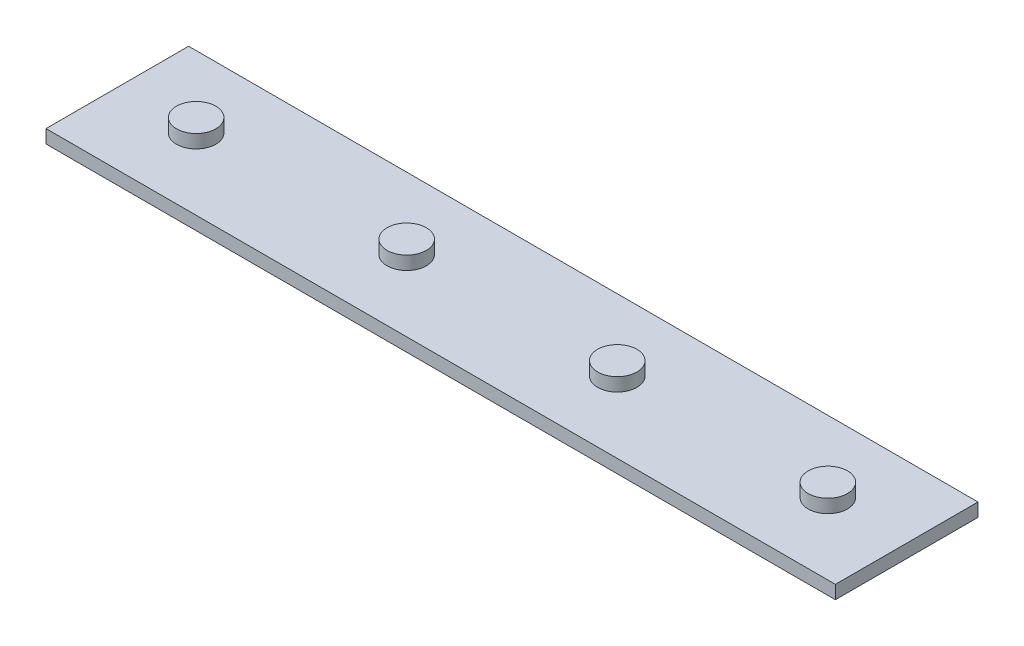
ISO-10303-21;
HEADER;
FILE_DESCRIPTION(('STEP AP214'),'2;1');
FILE_NAME('part.step','',(''),(''),'','','');
FILE_SCHEMA(('AUTOMOTIVE_DESIGN { 1 0 10303 214 1 1 1 1 }'));
ENDSEC;
DATA;
#1=APPLICATION_CONTEXT('core data for automotive mechanical design processes');
#2=APPLICATION_PROTOCOL_DEFINITION('international standard','automotive_design',2000,#1);
#3=PRODUCT_CONTEXT('',#1,'mechanical');
#4=PRODUCT('Part','Part','',(#3));
#5=PRODUCT_RELATED_PRODUCT_CATEGORY('part','',(#4));
#6=PRODUCT_DEFINITION_FORMATION('','',#4);
#7=PRODUCT_DEFINITION_CONTEXT('part definition',#1,'design');
#8=PRODUCT_DEFINITION('design','',#6,#7);
#9=PRODUCT_DEFINITION_SHAPE('','',#8);
#10=(LENGTH_UNIT() NAMED_UNIT(*) SI_UNIT(.MILLI.,.METRE.));
#11=(NAMED_UNIT(*) PLANE_ANGLE_UNIT() SI_UNIT($,.RADIAN.));
#12=(NAMED_UNIT(*) SI_UNIT($,.STERADIAN.) SOLID_ANGLE_UNIT());
#13=UNCERTAINTY_MEASURE_WITH_UNIT(LENGTH_MEASURE(1.E-05),#10,'distance_accuracy_value','');
#14=(GEOMETRIC_REPRESENTATION_CONTEXT(3) GLOBAL_UNCERTAINTY_ASSIGNED_CONTEXT((#13)) GLOBAL_UNIT_ASSIGNED_CONTEXT((#10,
#11,#12)) REPRESENTATION_CONTEXT('',''));
#15=CARTESIAN_POINT('',(0.,0.,0.));
#16=DIRECTION('',(0.,0.,1.));
#17=DIRECTION('',(1.,0.,0.));
#18=AXIS2_PLACEMENT_3D('',#15,#16,#17);
#19=CARTESIAN_POINT('',(140.579448456349,9.525,-25.4));
#20=DIRECTION('',(-1.,0.,0.));
#21=DIRECTION('',(0.,0.,1.));
#22=AXIS2_PLACEMENT_3D('',#19,#20,#21);
#23=PLANE('',#22);
#24=DIRECTION('',(0.,0.,-1.));
#25=VECTOR('',#24,1.);
#26=CARTESIAN_POINT('',(140.579448456349,4.7625,-25.4));
#27=LINE('',#26,#25);
#28=CARTESIAN_POINT('',(140.579448456349,4.7625,25.4));
#29=VERTEX_POINT('',#28);
#30=CARTESIAN_POINT('',(140.579448456349,4.7625,-25.4));
#31=VERTEX_POINT('',#30);
#32=EDGE_CURVE('E71',#29,#31,#27,.T.);
#33=ORIENTED_EDGE('',*,*,#32,.F.);
#34=DIRECTION('',(0.,-1.,0.));
#35=VECTOR('',#34,1.);
#36=CARTESIAN_POINT('',(140.579448456349,9.525,25.4));
#37=LINE('',#36,#35);
#38=CARTESIAN_POINT('',(140.579448456349,0.,25.4));
#39=VERTEX_POINT('',#38);
#40=EDGE_CURVE('E53',#29,#39,#37,.T.);
#41=ORIENTED_EDGE('',*,*,#40,.T.);
#42=DIRECTION('',(0.,0.,-1.));
#43=VECTOR('',#42,1.);
#44=CARTESIAN_POINT('',(140.579448456349,0.,-25.4));
#45=LINE('',#44,#43);
#46=CARTESIAN_POINT('',(140.579448456349,0.,-25.4));
#47=VERTEX_POINT('',#46);
#48=EDGE_CURVE('E76',#39,#47,#45,.T.);
#49=ORIENTED_EDGE('',*,*,#48,.T.);
#50=DIRECTION('',(0.,-1.,0.));
#51=VECTOR('',#50,1.);
#52=CARTESIAN_POINT('',(140.579448456349,9.525,-25.4));
#53=LINE('',#52,#51);
#54=EDGE_CURVE('E39',#31,#47,#53,.T.);
#55=ORIENTED_EDGE('',*,*,#54,.F.);
#56=EDGE_LOOP('',(#33,#41,#49,#55));
#57=FACE_BOUND('',#56,.T.);
#58=ADVANCED_FACE('F32',(#57),#23,.F.);
#59=CARTESIAN_POINT('',(-140.579448456349,9.525,-25.4));
#60=DIRECTION('',(0.,0.,1.));
#61=DIRECTION('',(1.,0.,0.));
#62=AXIS2_PLACEMENT_3D('',#59,#60,#61);
#63=PLANE('',#62);
#64=DIRECTION('',(-1.,0.,0.));
#65=VECTOR('',#64,1.);
#66=CARTESIAN_POINT('',(-140.579448456349,4.7625,-25.4));
#67=LINE('',#66,#65);
#68=CARTESIAN_POINT('',(-140.579448456349,4.7625,-25.4));
#69=VERTEX_POINT('',#68);
#70=EDGE_CURVE('E77',#31,#69,#67,.T.);
#71=ORIENTED_EDGE('',*,*,#70,.F.);
#72=ORIENTED_EDGE('',*,*,#54,.T.);
#73=DIRECTION('',(-1.,0.,0.));
#74=VECTOR('',#73,1.);
#75=CARTESIAN_POINT('',(-140.579448456349,0.,-25.4));
#76=LINE('',#75,#74);
#77=CARTESIAN_POINT('',(-140.579448456349,0.,-25.4));
#78=VERTEX_POINT('',#77);
#79=EDGE_CURVE('E96',#47,#78,#76,.T.);
#80=ORIENTED_EDGE('',*,*,#79,.T.);
#81=DIRECTION('',(0.,-1.,0.));
#82=VECTOR('',#81,1.);
#83=CARTESIAN_POINT('',(-140.579448456349,9.525,-25.4));
#84=LINE('',#83,#82);
#85=EDGE_CURVE('E85',#69,#78,#84,.T.);
#86=ORIENTED_EDGE('',*,*,#85,.F.);
#87=EDGE_LOOP('',(#71,#72,#80,#86));
#88=FACE_BOUND('',#87,.T.);
#89=ADVANCED_FACE('F94',(#88),#63,.F.);
#90=CARTESIAN_POINT('',(-140.579448456349,9.525,-25.4));
#91=DIRECTION('',(1.,0.,0.));
#92=DIRECTION('',(0.,0.,-1.));
#93=AXIS2_PLACEMENT_3D('',#90,#91,#92);
#94=PLANE('',#93);
#95=DIRECTION('',(0.,0.,1.));
#96=VECTOR('',#95,1.);
#97=CARTESIAN_POINT('',(-140.579448456349,4.7625,-25.4));
#98=LINE('',#97,#96);
#99=CARTESIAN_POINT('',(-140.579448456349,4.7625,25.4));
#100=VERTEX_POINT('',#99);
#101=EDGE_CURVE('E45',#69,#100,#98,.T.);
#102=ORIENTED_EDGE('',*,*,#101,.F.);
#103=ORIENTED_EDGE('',*,*,#85,.T.);
#104=DIRECTION('',(0.,0.,1.));
#105=VECTOR('',#104,1.);
#106=CARTESIAN_POINT('',(-140.579448456349,0.,-25.4));
#107=LINE('',#106,#105);
#108=CARTESIAN_POINT('',(-140.579448456349,0.,25.4));
#109=VERTEX_POINT('',#108);
#110=EDGE_CURVE('E87',#78,#109,#107,.T.);
#111=ORIENTED_EDGE('',*,*,#110,.T.);
#112=DIRECTION('',(0.,-1.,0.));
#113=VECTOR('',#112,1.);
#114=CARTESIAN_POINT('',(-140.579448456349,9.525,25.4));
#115=LINE('',#114,#113);
#116=EDGE_CURVE('E83',#100,#109,#115,.T.);
#117=ORIENTED_EDGE('',*,*,#116,.F.);
#118=EDGE_LOOP('',(#102,#103,#111,#117));
#119=FACE_BOUND('',#118,.T.);
#120=ADVANCED_FACE('F105',(#119),#94,.F.);
#121=CARTESIAN_POINT('',(-140.579448456349,9.525,25.4));
#122=DIRECTION('',(0.,0.,-1.));
#123=DIRECTION('',(-1.,0.,0.));
#124=AXIS2_PLACEMENT_3D('',#121,#122,#123);
#125=PLANE('',#124);
#126=DIRECTION('',(1.,0.,0.));
#127=VECTOR('',#126,1.);
#128=CARTESIAN_POINT('',(-140.579448456349,4.7625,25.4));
#129=LINE('',#128,#127);
#130=EDGE_CURVE('E12',#100,#29,#129,.T.);
#131=ORIENTED_EDGE('',*,*,#130,.F.);
#132=ORIENTED_EDGE('',*,*,#116,.T.);
#133=DIRECTION('',(1.,0.,0.));
#134=VECTOR('',#133,1.);
#135=CARTESIAN_POINT('',(-140.579448456349,0.,25.4));
#136=LINE('',#135,#134);
#137=EDGE_CURVE('E81',#109,#39,#136,.T.);
#138=ORIENTED_EDGE('',*,*,#137,.T.);
#139=ORIENTED_EDGE('',*,*,#40,.F.);
#140=EDGE_LOOP('',(#131,#132,#138,#139));
#141=FACE_BOUND('',#140,.T.);
#142=ADVANCED_FACE('F79',(#141),#125,.F.);
#143=CARTESIAN_POINT('',(140.579448456349,0.,25.4));
#144=DIRECTION('',(0.,1.,0.));
#145=DIRECTION('',(0.,0.,1.));
#146=AXIS2_PLACEMENT_3D('',#143,#144,#145);
#147=PLANE('',#146);
#148=ORIENTED_EDGE('',*,*,#48,.F.);
#149=ORIENTED_EDGE('',*,*,#137,.F.);
#150=ORIENTED_EDGE('',*,*,#110,.F.);
#151=ORIENTED_EDGE('',*,*,#79,.F.);
#152=EDGE_LOOP('',(#148,#149,#150,#151));
#153=FACE_BOUND('',#152,.T.);
#154=ADVANCED_FACE('F99',(#153),#147,.F.);
#155=CARTESIAN_POINT('',(0.,4.7625,0.));
#156=DIRECTION('',(0.,1.,0.));
#157=DIRECTION('',(0.,0.,1.));
#158=AXIS2_PLACEMENT_3D('',#155,#156,#157);
#159=PLANE('',#158);
#160=CARTESIAN_POINT('',(-112.5,4.7625,0.));
#161=DIRECTION('',(0.,1.,0.));
#162=DIRECTION('',(0.,0.,1.));
#163=AXIS2_PLACEMENT_3D('',#160,#161,#162);
#164=CIRCLE('',#163,7.);
#165=CARTESIAN_POINT('',(-112.5,4.7625,7.));
#166=VERTEX_POINT('',#165);
#167=EDGE_CURVE('E106',#166,#166,#164,.T.);
#168=ORIENTED_EDGE('',*,*,#167,.F.);
#169=EDGE_LOOP('',(#168));
#170=FACE_BOUND('',#169,.T.);
#171=CARTESIAN_POINT('',(-37.5,4.7625,0.));
#172=DIRECTION('',(0.,1.,0.));
#173=DIRECTION('',(0.,0.,1.));
#174=AXIS2_PLACEMENT_3D('',#171,#172,#173);
#175=CIRCLE('',#174,7.);
#176=CARTESIAN_POINT('',(-37.5,4.7625,7.));
#177=VERTEX_POINT('',#176);
#178=EDGE_CURVE('E113',#177,#177,#175,.T.);
#179=ORIENTED_EDGE('',*,*,#178,.F.);
#180=EDGE_LOOP('',(#179));
#181=FACE_BOUND('',#180,.T.);
#182=CARTESIAN_POINT('',(37.5,4.7625,0.));
#183=DIRECTION('',(0.,1.,0.));
#184=DIRECTION('',(0.,0.,1.));
#185=AXIS2_PLACEMENT_3D('',#182,#183,#184);
#186=CIRCLE('',#185,7.);
#187=CARTESIAN_POINT('',(37.5,4.7625,7.));
#188=VERTEX_POINT('',#187);
#189=EDGE_CURVE('E118',#188,#188,#186,.T.);
#190=ORIENTED_EDGE('',*,*,#189,.F.);
#191=EDGE_LOOP('',(#190));
#192=FACE_BOUND('',#191,.T.);
#193=CARTESIAN_POINT('',(112.5,4.7625,0.));
#194=DIRECTION('',(0.,1.,0.));
#195=DIRECTION('',(0.,0.,1.));
#196=AXIS2_PLACEMENT_3D('',#193,#194,#195);
#197=CIRCLE('',#196,7.);
#198=CARTESIAN_POINT('',(112.5,4.7625,7.));
#199=VERTEX_POINT('',#198);
#200=EDGE_CURVE('E124',#199,#199,#197,.T.);
#201=ORIENTED_EDGE('',*,*,#200,.F.);
#202=EDGE_LOOP('',(#201));
#203=FACE_BOUND('',#202,.T.);
#204=ORIENTED_EDGE('',*,*,#32,.T.);
#205=ORIENTED_EDGE('',*,*,#70,.T.);
#206=ORIENTED_EDGE('',*,*,#101,.T.);
#207=ORIENTED_EDGE('',*,*,#130,.T.);
#208=EDGE_LOOP('',(#204,#205,#206,#207));
#209=FACE_BOUND('',#208,.T.);
#210=ADVANCED_FACE('F70',(#170,#181,#192,#203,#209),#159,.T.);
#211=CARTESIAN_POINT('',(-112.5,4.7625,0.));
#212=DIRECTION('',(0.,1.,0.));
#213=DIRECTION('',(0.,0.,1.));
#214=AXIS2_PLACEMENT_3D('',#211,#212,#213);
#215=CYLINDRICAL_SURFACE('',#214,7.);
#216=ORIENTED_EDGE('',*,*,#167,.T.);
#217=EDGE_LOOP('',(#216));
#218=FACE_BOUND('',#217,.T.);
#219=CARTESIAN_POINT('',(-112.5,9.525,0.));
#220=DIRECTION('',(0.,1.,0.));
#221=DIRECTION('',(0.,0.,1.));
#222=AXIS2_PLACEMENT_3D('',#219,#220,#221);
#223=CIRCLE('',#222,7.);
#224=CARTESIAN_POINT('',(-112.5,9.525,7.));
#225=VERTEX_POINT('',#224);
#226=EDGE_CURVE('E109',#225,#225,#223,.T.);
#227=ORIENTED_EDGE('',*,*,#226,.F.);
#228=EDGE_LOOP('',(#227));
#229=FACE_BOUND('',#228,.T.);
#230=ADVANCED_FACE('F137',(#218,#229),#215,.T.);
#231=CARTESIAN_POINT('',(-37.5,4.7625,0.));
#232=DIRECTION('',(0.,1.,0.));
#233=DIRECTION('',(0.,0.,1.));
#234=AXIS2_PLACEMENT_3D('',#231,#232,#233);
#235=CYLINDRICAL_SURFACE('',#234,7.);
#236=ORIENTED_EDGE('',*,*,#178,.T.);
#237=EDGE_LOOP('',(#236));
#238=FACE_BOUND('',#237,.T.);
#239=CARTESIAN_POINT('',(-37.5,9.525,0.));
#240=DIRECTION('',(0.,1.,0.));
#241=DIRECTION('',(0.,0.,1.));
#242=AXIS2_PLACEMENT_3D('',#239,#240,#241);
#243=CIRCLE('',#242,7.);
#244=CARTESIAN_POINT('',(-37.5,9.525,7.));
#245=VERTEX_POINT('',#244);
#246=EDGE_CURVE('E115',#245,#245,#243,.T.);
#247=ORIENTED_EDGE('',*,*,#246,.F.);
#248=EDGE_LOOP('',(#247));
#249=FACE_BOUND('',#248,.T.);
#250=ADVANCED_FACE('F144',(#238,#249),#235,.T.);
#251=CARTESIAN_POINT('',(37.5,4.7625,0.));
#252=DIRECTION('',(0.,1.,0.));
#253=DIRECTION('',(0.,0.,1.));
#254=AXIS2_PLACEMENT_3D('',#251,#252,#253);
#255=CYLINDRICAL_SURFACE('',#254,7.);
#256=ORIENTED_EDGE('',*,*,#189,.T.);
#257=EDGE_LOOP('',(#256));
#258=FACE_BOUND('',#257,.T.);
#259=CARTESIAN_POINT('',(37.5,9.525,0.));
#260=DIRECTION('',(0.,1.,0.));
#261=DIRECTION('',(0.,0.,1.));
#262=AXIS2_PLACEMENT_3D('',#259,#260,#261);
#263=CIRCLE('',#262,7.);
#264=CARTESIAN_POINT('',(37.5,9.525,7.));
#265=VERTEX_POINT('',#264);
#266=EDGE_CURVE('E121',#265,#265,#263,.T.);
#267=ORIENTED_EDGE('',*,*,#266,.F.);
#268=EDGE_LOOP('',(#267));
#269=FACE_BOUND('',#268,.T.);
#270=ADVANCED_FACE('F182',(#258,#269),#255,.T.);
#271=CARTESIAN_POINT('',(112.5,4.7625,0.));
#272=DIRECTION('',(0.,1.,0.));
#273=DIRECTION('',(0.,0.,1.));
#274=AXIS2_PLACEMENT_3D('',#271,#272,#273);
#275=CYLINDRICAL_SURFACE('',#274,7.);
#276=ORIENTED_EDGE('',*,*,#200,.T.);
#277=EDGE_LOOP('',(#276));
#278=FACE_BOUND('',#277,.T.);
#279=CARTESIAN_POINT('',(112.5,9.525,0.));
#280=DIRECTION('',(0.,1.,0.));
#281=DIRECTION('',(0.,0.,1.));
#282=AXIS2_PLACEMENT_3D('',#279,#280,#281);
#283=CIRCLE('',#282,7.);
#284=CARTESIAN_POINT('',(112.5,9.525,7.));
#285=VERTEX_POINT('',#284);
#286=EDGE_CURVE('E127',#285,#285,#283,.T.);
#287=ORIENTED_EDGE('',*,*,#286,.F.);
#288=EDGE_LOOP('',(#287));
#289=FACE_BOUND('',#288,.T.);
#290=ADVANCED_FACE('F133',(#278,#289),#275,.T.);
#291=CARTESIAN_POINT('',(140.579448456349,9.525,25.4));
#292=DIRECTION('',(0.,1.,0.));
#293=DIRECTION('',(0.,0.,1.));
#294=AXIS2_PLACEMENT_3D('',#291,#292,#293);
#295=PLANE('',#294);
#296=ORIENTED_EDGE('',*,*,#266,.T.);
#297=EDGE_LOOP('',(#296));
#298=FACE_BOUND('',#297,.T.);
#299=ADVANCED_FACE('F171',(#298),#295,.T.);
#300=ORIENTED_EDGE('',*,*,#246,.T.);
#301=EDGE_LOOP('',(#300));
#302=FACE_BOUND('',#301,.T.);
#303=ADVANCED_FACE('F164',(#302),#295,.T.);
#304=ORIENTED_EDGE('',*,*,#226,.T.);
#305=EDGE_LOOP('',(#304));
#306=FACE_BOUND('',#305,.T.);
#307=ADVANCED_FACE('F161',(#306),#295,.T.);
#308=ORIENTED_EDGE('',*,*,#286,.T.);
#309=EDGE_LOOP('',(#308));
#310=FACE_BOUND('',#309,.T.);
#311=ADVANCED_FACE('F163',(#310),#295,.T.);
#312=CLOSED_SHELL('',(#58,#89,#120,#142,#154,#210,#230,#250,#270,#290,#299,#303,#307,#311));
#313=MANIFOLD_SOLID_BREP('B2',#312);
#314=ADVANCED_BREP_SHAPE_REPRESENTATION('',(#18,#313),#14);
#315=SHAPE_DEFINITION_REPRESENTATION(#9,#314);
ENDSEC;
END-ISO-10303-21;
